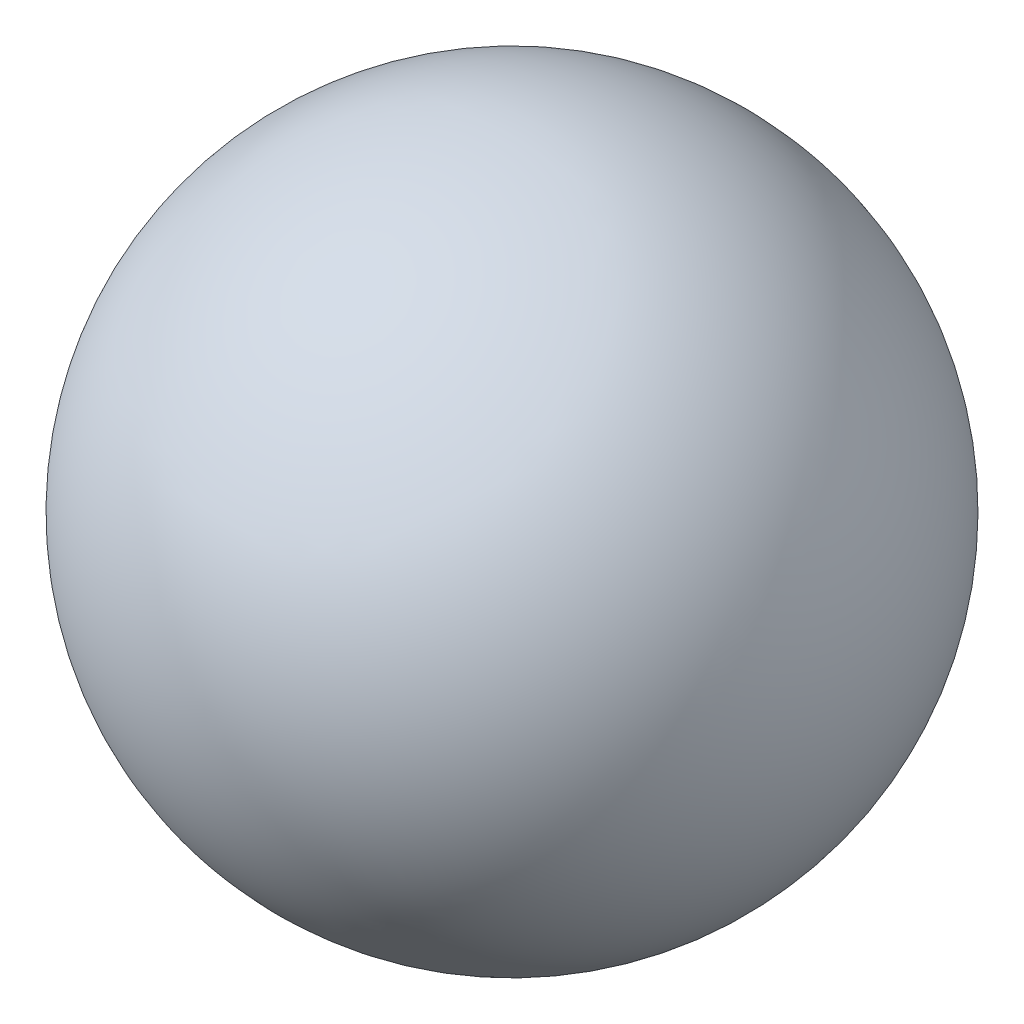
ISO-10303-21;
HEADER;
FILE_DESCRIPTION(('STEP AP214'),'2;1');
FILE_NAME('part.step','',(''),(''),'','','');
FILE_SCHEMA(('AUTOMOTIVE_DESIGN { 1 0 10303 214 1 1 1 1 }'));
ENDSEC;
DATA;
#1=APPLICATION_CONTEXT('core data for automotive mechanical design processes');
#2=APPLICATION_PROTOCOL_DEFINITION('international standard','automotive_design',2000,#1);
#3=PRODUCT_CONTEXT('',#1,'mechanical');
#4=PRODUCT('Part','Part','',(#3));
#5=PRODUCT_RELATED_PRODUCT_CATEGORY('part','',(#4));
#6=PRODUCT_DEFINITION_FORMATION('','',#4);
#7=PRODUCT_DEFINITION_CONTEXT('part definition',#1,'design');
#8=PRODUCT_DEFINITION('design','',#6,#7);
#9=PRODUCT_DEFINITION_SHAPE('','',#8);
#10=(LENGTH_UNIT() NAMED_UNIT(*) SI_UNIT(.MILLI.,.METRE.));
#11=(NAMED_UNIT(*) PLANE_ANGLE_UNIT() SI_UNIT($,.RADIAN.));
#12=(NAMED_UNIT(*) SI_UNIT($,.STERADIAN.) SOLID_ANGLE_UNIT());
#13=UNCERTAINTY_MEASURE_WITH_UNIT(LENGTH_MEASURE(1.E-05),#10,'distance_accuracy_value','');
#14=(GEOMETRIC_REPRESENTATION_CONTEXT(3) GLOBAL_UNCERTAINTY_ASSIGNED_CONTEXT((#13)) GLOBAL_UNIT_ASSIGNED_CONTEXT((#10,
#11,#12)) REPRESENTATION_CONTEXT('',''));
#15=CARTESIAN_POINT('',(0.,0.,0.));
#16=DIRECTION('',(0.,0.,1.));
#17=DIRECTION('',(1.,0.,0.));
#18=AXIS2_PLACEMENT_3D('',#15,#16,#17);
#19=CARTESIAN_POINT('',(64.16,-28.1965571573831,63.3952273713915));
#20=DIRECTION('',(0.,-0.406389996935606,0.91369971565645));
#21=DIRECTION('',(0.173648177666934,-0.899818563903522,-0.400216019728792));
#22=AXIS2_PLACEMENT_3D('',#19,#20,#21);
#23=SPHERICAL_SURFACE('',#22,7.15);
#24=CARTESIAN_POINT('',(64.16,-31.1022456354727,69.9281803383351));
#25=VERTEX_POINT('',#24);
#26=VERTEX_LOOP('',#25);
#27=FACE_BOUND('',#26,.T.);
#28=CARTESIAN_POINT('',(64.16,-25.2908686792935,56.8622744044479));
#29=VERTEX_POINT('',#28);
#30=VERTEX_LOOP('',#29);
#31=FACE_BOUND('',#30,.T.);
#32=ADVANCED_FACE('F15',(#27,#31),#23,.T.);
#33=CLOSED_SHELL('',(#32));
#34=MANIFOLD_SOLID_BREP('B1',#33);
#35=ADVANCED_BREP_SHAPE_REPRESENTATION('',(#18,#34),#14);
#36=SHAPE_DEFINITION_REPRESENTATION(#9,#35);
ENDSEC;
END-ISO-10303-21;
